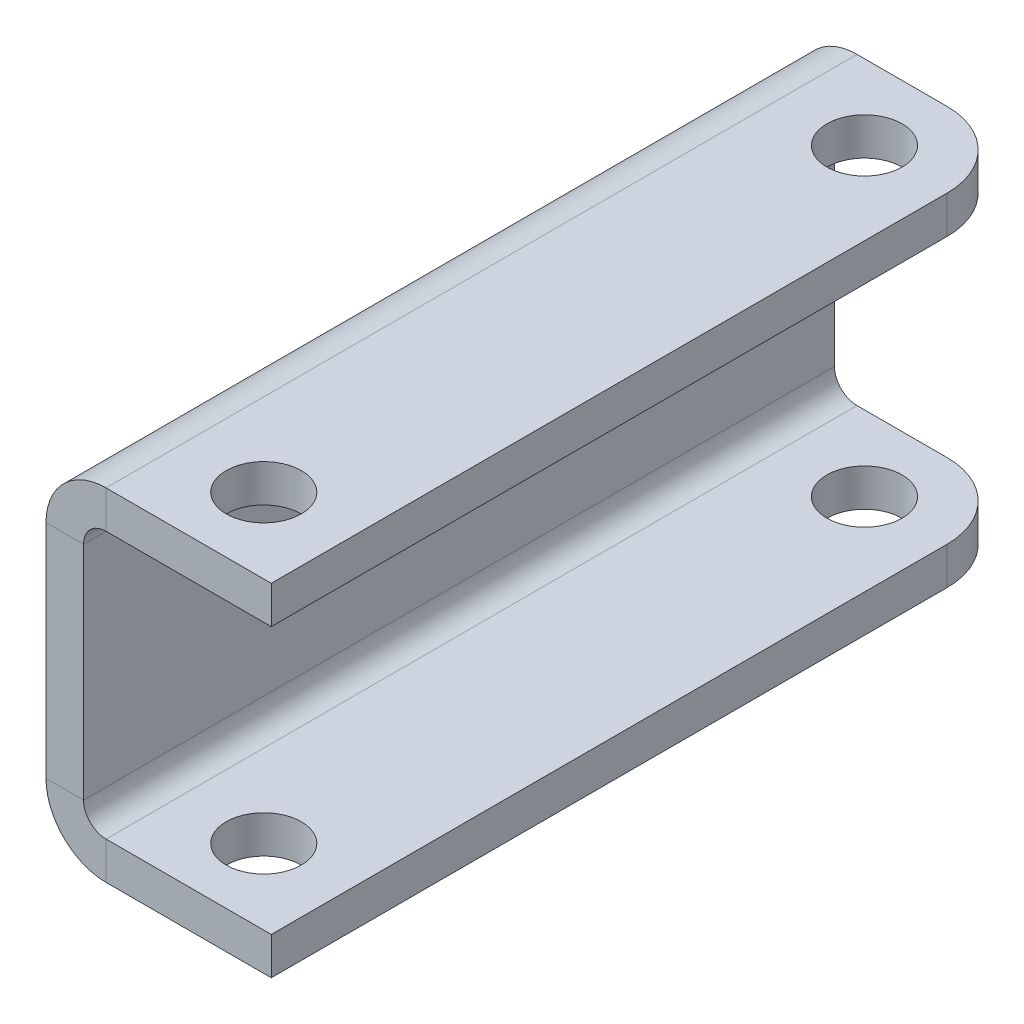
ISO-10303-21;
HEADER;
FILE_DESCRIPTION(('STEP AP214'),'2;1');
FILE_NAME('part.step','',(''),(''),'','','');
FILE_SCHEMA(('AUTOMOTIVE_DESIGN { 1 0 10303 214 1 1 1 1 }'));
ENDSEC;
DATA;
#1=APPLICATION_CONTEXT('core data for automotive mechanical design processes');
#2=APPLICATION_PROTOCOL_DEFINITION('international standard','automotive_design',2000,#1);
#3=PRODUCT_CONTEXT('',#1,'mechanical');
#4=PRODUCT('Part','Part','',(#3));
#5=PRODUCT_RELATED_PRODUCT_CATEGORY('part','',(#4));
#6=PRODUCT_DEFINITION_FORMATION('','',#4);
#7=PRODUCT_DEFINITION_CONTEXT('part definition',#1,'design');
#8=PRODUCT_DEFINITION('design','',#6,#7);
#9=PRODUCT_DEFINITION_SHAPE('','',#8);
#10=(LENGTH_UNIT() NAMED_UNIT(*) SI_UNIT(.MILLI.,.METRE.));
#11=(NAMED_UNIT(*) PLANE_ANGLE_UNIT() SI_UNIT($,.RADIAN.));
#12=(NAMED_UNIT(*) SI_UNIT($,.STERADIAN.) SOLID_ANGLE_UNIT());
#13=UNCERTAINTY_MEASURE_WITH_UNIT(LENGTH_MEASURE(1.E-05),#10,'distance_accuracy_value','');
#14=(GEOMETRIC_REPRESENTATION_CONTEXT(3) GLOBAL_UNCERTAINTY_ASSIGNED_CONTEXT((#13)) GLOBAL_UNIT_ASSIGNED_CONTEXT((#10,
#11,#12)) REPRESENTATION_CONTEXT('',''));
#15=CARTESIAN_POINT('',(0.,0.,0.));
#16=DIRECTION('',(0.,0.,1.));
#17=DIRECTION('',(1.,0.,0.));
#18=AXIS2_PLACEMENT_3D('',#15,#16,#17);
#19=CARTESIAN_POINT('',(346.,29.4999999999994,100.));
#20=DIRECTION('',(0.,0.,1.));
#21=DIRECTION('',(1.,0.,0.));
#22=AXIS2_PLACEMENT_3D('',#19,#20,#21);
#23=PLANE('',#22);
#24=DIRECTION('',(-1.,0.,0.));
#25=VECTOR('',#24,1.);
#26=CARTESIAN_POINT('',(330.,29.4999999999994,100.));
#27=LINE('',#26,#25);
#28=CARTESIAN_POINT('',(340.,29.4999999999994,100.));
#29=VERTEX_POINT('',#28);
#30=CARTESIAN_POINT('',(330.,29.4999999999994,100.));
#31=VERTEX_POINT('',#30);
#32=EDGE_CURVE('E11',#29,#31,#27,.T.);
#33=ORIENTED_EDGE('',*,*,#32,.F.);
#34=CARTESIAN_POINT('',(346.,29.4999999999994,100.));
#35=DIRECTION('',(0.,0.,1.));
#36=DIRECTION('',(1.,0.,0.));
#37=AXIS2_PLACEMENT_3D('',#34,#35,#36);
#38=CIRCLE('',#37,6.);
#39=CARTESIAN_POINT('',(346.,35.4999999999994,100.));
#40=VERTEX_POINT('',#39);
#41=EDGE_CURVE('E105',#29,#40,#38,.F.);
#42=ORIENTED_EDGE('',*,*,#41,.T.);
#43=DIRECTION('',(0.,1.,0.));
#44=VECTOR('',#43,1.);
#45=CARTESIAN_POINT('',(346.,45.4999999999994,100.));
#46=LINE('',#45,#44);
#47=CARTESIAN_POINT('',(346.,45.4999999999994,100.));
#48=VERTEX_POINT('',#47);
#49=EDGE_CURVE('E47',#40,#48,#46,.T.);
#50=ORIENTED_EDGE('',*,*,#49,.T.);
#51=CARTESIAN_POINT('',(346.,29.4999999999994,100.));
#52=DIRECTION('',(0.,0.,-1.));
#53=DIRECTION('',(-1.,0.,0.));
#54=AXIS2_PLACEMENT_3D('',#51,#52,#53);
#55=CIRCLE('',#54,16.);
#56=EDGE_CURVE('E108',#31,#48,#55,.T.);
#57=ORIENTED_EDGE('',*,*,#56,.F.);
#58=EDGE_LOOP('',(#33,#42,#50,#57));
#59=FACE_BOUND('',#58,.T.);
#60=ADVANCED_FACE('F37',(#59),#23,.T.);
#61=CARTESIAN_POINT('',(340.,45.4999999999994,100.));
#62=DIRECTION('',(0.,0.,-1.));
#63=DIRECTION('',(1.,0.,0.));
#64=AXIS2_PLACEMENT_3D('',#61,#62,#63);
#65=PLANE('',#64);
#66=ORIENTED_EDGE('',*,*,#49,.F.);
#67=DIRECTION('',(1.,0.,0.));
#68=VECTOR('',#67,1.);
#69=CARTESIAN_POINT('',(340.,35.4999999999994,100.));
#70=LINE('',#69,#68);
#71=CARTESIAN_POINT('',(390.,35.4999999999994,100.));
#72=VERTEX_POINT('',#71);
#73=EDGE_CURVE('E141',#40,#72,#70,.T.);
#74=ORIENTED_EDGE('',*,*,#73,.T.);
#75=DIRECTION('',(0.,1.,0.));
#76=VECTOR('',#75,1.);
#77=CARTESIAN_POINT('',(390.,45.4999999999994,100.));
#78=LINE('',#77,#76);
#79=CARTESIAN_POINT('',(390.,45.4999999999994,100.));
#80=VERTEX_POINT('',#79);
#81=EDGE_CURVE('E187',#72,#80,#78,.T.);
#82=ORIENTED_EDGE('',*,*,#81,.T.);
#83=DIRECTION('',(1.,0.,0.));
#84=VECTOR('',#83,1.);
#85=CARTESIAN_POINT('',(340.,45.4999999999994,100.));
#86=LINE('',#85,#84);
#87=EDGE_CURVE('E208',#48,#80,#86,.T.);
#88=ORIENTED_EDGE('',*,*,#87,.F.);
#89=EDGE_LOOP('',(#66,#74,#82,#88));
#90=FACE_BOUND('',#89,.T.);
#91=ADVANCED_FACE('F209',(#90),#65,.F.);
#92=CARTESIAN_POINT('',(390.,45.4999999999994,-100.));
#93=DIRECTION('',(1.,0.,0.));
#94=DIRECTION('',(0.,0.,1.));
#95=AXIS2_PLACEMENT_3D('',#92,#93,#94);
#96=PLANE('',#95);
#97=ORIENTED_EDGE('',*,*,#81,.F.);
#98=DIRECTION('',(0.,0.,1.));
#99=VECTOR('',#98,1.);
#100=CARTESIAN_POINT('',(390.,35.4999999999994,-100.));
#101=LINE('',#100,#99);
#102=CARTESIAN_POINT('',(390.,35.4999999999994,-80.));
#103=VERTEX_POINT('',#102);
#104=EDGE_CURVE('E159',#103,#72,#101,.T.);
#105=ORIENTED_EDGE('',*,*,#104,.F.);
#106=DIRECTION('',(0.,1.,0.));
#107=VECTOR('',#106,1.);
#108=CARTESIAN_POINT('',(390.,45.4999999999994,-80.));
#109=LINE('',#108,#107);
#110=CARTESIAN_POINT('',(390.,45.4999999999994,-80.));
#111=VERTEX_POINT('',#110);
#112=EDGE_CURVE('E184',#103,#111,#109,.T.);
#113=ORIENTED_EDGE('',*,*,#112,.T.);
#114=DIRECTION('',(0.,0.,1.));
#115=VECTOR('',#114,1.);
#116=CARTESIAN_POINT('',(390.,45.4999999999994,-100.));
#117=LINE('',#116,#115);
#118=EDGE_CURVE('E296',#111,#80,#117,.T.);
#119=ORIENTED_EDGE('',*,*,#118,.T.);
#120=EDGE_LOOP('',(#97,#105,#113,#119));
#121=FACE_BOUND('',#120,.T.);
#122=ADVANCED_FACE('F295',(#121),#96,.T.);
#123=CARTESIAN_POINT('',(370.,45.4999999999994,-80.));
#124=DIRECTION('',(0.,-1.,0.));
#125=DIRECTION('',(1.,0.,0.));
#126=AXIS2_PLACEMENT_3D('',#123,#124,#125);
#127=CYLINDRICAL_SURFACE('',#126,20.);
#128=ORIENTED_EDGE('',*,*,#112,.F.);
#129=CARTESIAN_POINT('',(370.,35.4999999999994,-80.));
#130=DIRECTION('',(0.,-1.,0.));
#131=DIRECTION('',(1.,0.,0.));
#132=AXIS2_PLACEMENT_3D('',#129,#130,#131);
#133=CIRCLE('',#132,20.);
#134=CARTESIAN_POINT('',(370.,35.4999999999994,-100.));
#135=VERTEX_POINT('',#134);
#136=EDGE_CURVE('E286',#103,#135,#133,.F.);
#137=ORIENTED_EDGE('',*,*,#136,.T.);
#138=DIRECTION('',(0.,1.,0.));
#139=VECTOR('',#138,1.);
#140=CARTESIAN_POINT('',(370.,45.4999999999994,-100.));
#141=LINE('',#140,#139);
#142=CARTESIAN_POINT('',(370.,45.4999999999994,-100.));
#143=VERTEX_POINT('',#142);
#144=EDGE_CURVE('E181',#135,#143,#141,.T.);
#145=ORIENTED_EDGE('',*,*,#144,.T.);
#146=CARTESIAN_POINT('',(370.,45.4999999999994,-80.));
#147=DIRECTION('',(0.,-1.,0.));
#148=DIRECTION('',(1.,0.,0.));
#149=AXIS2_PLACEMENT_3D('',#146,#147,#148);
#150=CIRCLE('',#149,20.);
#151=EDGE_CURVE('E222',#111,#143,#150,.F.);
#152=ORIENTED_EDGE('',*,*,#151,.F.);
#153=EDGE_LOOP('',(#128,#137,#145,#152));
#154=FACE_BOUND('',#153,.T.);
#155=ADVANCED_FACE('F387',(#154),#127,.T.);
#156=CARTESIAN_POINT('',(340.,45.4999999999994,-100.));
#157=DIRECTION('',(0.,0.,-1.));
#158=DIRECTION('',(1.,0.,0.));
#159=AXIS2_PLACEMENT_3D('',#156,#157,#158);
#160=PLANE('',#159);
#161=ORIENTED_EDGE('',*,*,#144,.F.);
#162=DIRECTION('',(1.,0.,0.));
#163=VECTOR('',#162,1.);
#164=CARTESIAN_POINT('',(340.,35.4999999999994,-100.));
#165=LINE('',#164,#163);
#166=CARTESIAN_POINT('',(346.,35.4999999999994,-100.));
#167=VERTEX_POINT('',#166);
#168=EDGE_CURVE('E266',#167,#135,#165,.T.);
#169=ORIENTED_EDGE('',*,*,#168,.F.);
#170=DIRECTION('',(0.,1.,0.));
#171=VECTOR('',#170,1.);
#172=CARTESIAN_POINT('',(346.,45.4999999999994,-100.));
#173=LINE('',#172,#171);
#174=CARTESIAN_POINT('',(346.,45.4999999999994,-100.));
#175=VERTEX_POINT('',#174);
#176=EDGE_CURVE('E178',#167,#175,#173,.T.);
#177=ORIENTED_EDGE('',*,*,#176,.T.);
#178=DIRECTION('',(1.,0.,0.));
#179=VECTOR('',#178,1.);
#180=CARTESIAN_POINT('',(340.,45.4999999999994,-100.));
#181=LINE('',#180,#179);
#182=EDGE_CURVE('E219',#175,#143,#181,.T.);
#183=ORIENTED_EDGE('',*,*,#182,.T.);
#184=EDGE_LOOP('',(#161,#169,#177,#183));
#185=FACE_BOUND('',#184,.T.);
#186=ADVANCED_FACE('F383',(#185),#160,.T.);
#187=CARTESIAN_POINT('',(346.,29.4999999999994,-100.));
#188=DIRECTION('',(0.,0.,1.));
#189=DIRECTION('',(1.,0.,0.));
#190=AXIS2_PLACEMENT_3D('',#187,#188,#189);
#191=PLANE('',#190);
#192=ORIENTED_EDGE('',*,*,#176,.F.);
#193=CARTESIAN_POINT('',(346.,29.4999999999994,-100.));
#194=DIRECTION('',(0.,0.,1.));
#195=DIRECTION('',(1.,0.,0.));
#196=AXIS2_PLACEMENT_3D('',#193,#194,#195);
#197=CIRCLE('',#196,6.);
#198=CARTESIAN_POINT('',(340.,29.4999999999994,-100.));
#199=VERTEX_POINT('',#198);
#200=EDGE_CURVE('E134',#199,#167,#197,.F.);
#201=ORIENTED_EDGE('',*,*,#200,.F.);
#202=DIRECTION('',(-1.,0.,0.));
#203=VECTOR('',#202,1.);
#204=CARTESIAN_POINT('',(330.,29.4999999999994,-100.));
#205=LINE('',#204,#203);
#206=CARTESIAN_POINT('',(330.,29.4999999999994,-100.));
#207=VERTEX_POINT('',#206);
#208=EDGE_CURVE('E175',#199,#207,#205,.T.);
#209=ORIENTED_EDGE('',*,*,#208,.T.);
#210=CARTESIAN_POINT('',(346.,29.4999999999994,-100.));
#211=DIRECTION('',(0.,0.,-1.));
#212=DIRECTION('',(-1.,0.,0.));
#213=AXIS2_PLACEMENT_3D('',#210,#211,#212);
#214=CIRCLE('',#213,16.);
#215=EDGE_CURVE('E204',#207,#175,#214,.T.);
#216=ORIENTED_EDGE('',*,*,#215,.T.);
#217=EDGE_LOOP('',(#192,#201,#209,#216));
#218=FACE_BOUND('',#217,.T.);
#219=ADVANCED_FACE('F379',(#218),#191,.F.);
#220=CARTESIAN_POINT('',(330.,-35.5000000000006,-100.));
#221=DIRECTION('',(0.,0.,-1.));
#222=DIRECTION('',(0.,1.,0.));
#223=AXIS2_PLACEMENT_3D('',#220,#221,#222);
#224=PLANE('',#223);
#225=ORIENTED_EDGE('',*,*,#208,.F.);
#226=DIRECTION('',(0.,1.,0.));
#227=VECTOR('',#226,1.);
#228=CARTESIAN_POINT('',(340.,-35.5000000000006,-100.));
#229=LINE('',#228,#227);
#230=CARTESIAN_POINT('',(340.,-29.5000000000006,-100.));
#231=VERTEX_POINT('',#230);
#232=EDGE_CURVE('E124',#231,#199,#229,.T.);
#233=ORIENTED_EDGE('',*,*,#232,.F.);
#234=DIRECTION('',(-1.,0.,0.));
#235=VECTOR('',#234,1.);
#236=CARTESIAN_POINT('',(330.,-29.5000000000006,-100.));
#237=LINE('',#236,#235);
#238=CARTESIAN_POINT('',(330.,-29.5000000000006,-100.));
#239=VERTEX_POINT('',#238);
#240=EDGE_CURVE('E172',#231,#239,#237,.T.);
#241=ORIENTED_EDGE('',*,*,#240,.T.);
#242=DIRECTION('',(0.,1.,0.));
#243=VECTOR('',#242,1.);
#244=CARTESIAN_POINT('',(330.,-35.5000000000006,-100.));
#245=LINE('',#244,#243);
#246=EDGE_CURVE('E228',#239,#207,#245,.T.);
#247=ORIENTED_EDGE('',*,*,#246,.T.);
#248=EDGE_LOOP('',(#225,#233,#241,#247));
#249=FACE_BOUND('',#248,.T.);
#250=ADVANCED_FACE('F376',(#249),#224,.T.);
#251=CARTESIAN_POINT('',(346.,-29.5000000000006,-100.));
#252=DIRECTION('',(0.,0.,1.));
#253=DIRECTION('',(1.,0.,0.));
#254=AXIS2_PLACEMENT_3D('',#251,#252,#253);
#255=PLANE('',#254);
#256=ORIENTED_EDGE('',*,*,#240,.F.);
#257=CARTESIAN_POINT('',(346.,-29.5000000000006,-100.));
#258=DIRECTION('',(0.,0.,1.));
#259=DIRECTION('',(1.,0.,0.));
#260=AXIS2_PLACEMENT_3D('',#257,#258,#259);
#261=CIRCLE('',#260,6.);
#262=CARTESIAN_POINT('',(346.,-35.5000000000006,-100.));
#263=VERTEX_POINT('',#262);
#264=EDGE_CURVE('E268',#263,#231,#261,.F.);
#265=ORIENTED_EDGE('',*,*,#264,.F.);
#266=DIRECTION('',(0.,-1.,0.));
#267=VECTOR('',#266,1.);
#268=CARTESIAN_POINT('',(346.,-45.5000000000006,-100.));
#269=LINE('',#268,#267);
#270=CARTESIAN_POINT('',(346.,-45.5000000000006,-100.));
#271=VERTEX_POINT('',#270);
#272=EDGE_CURVE('E55',#263,#271,#269,.T.);
#273=ORIENTED_EDGE('',*,*,#272,.T.);
#274=CARTESIAN_POINT('',(346.,-29.5000000000006,-100.));
#275=DIRECTION('',(0.,0.,-1.));
#276=DIRECTION('',(-1.,0.,0.));
#277=AXIS2_PLACEMENT_3D('',#274,#275,#276);
#278=CIRCLE('',#277,16.);
#279=EDGE_CURVE('E257',#271,#239,#278,.T.);
#280=ORIENTED_EDGE('',*,*,#279,.T.);
#281=EDGE_LOOP('',(#256,#265,#273,#280));
#282=FACE_BOUND('',#281,.T.);
#283=ADVANCED_FACE('F372',(#282),#255,.F.);
#284=CARTESIAN_POINT('',(340.,-45.5000000000006,-100.));
#285=DIRECTION('',(0.,0.,-1.));
#286=DIRECTION('',(-1.,0.,0.));
#287=AXIS2_PLACEMENT_3D('',#284,#285,#286);
#288=PLANE('',#287);
#289=ORIENTED_EDGE('',*,*,#272,.F.);
#290=DIRECTION('',(-1.,0.,0.));
#291=VECTOR('',#290,1.);
#292=CARTESIAN_POINT('',(340.,-35.5000000000006,-100.));
#293=LINE('',#292,#291);
#294=CARTESIAN_POINT('',(370.,-35.5000000000006,-100.));
#295=VERTEX_POINT('',#294);
#296=EDGE_CURVE('E152',#295,#263,#293,.T.);
#297=ORIENTED_EDGE('',*,*,#296,.F.);
#298=DIRECTION('',(0.,-1.,0.));
#299=VECTOR('',#298,1.);
#300=CARTESIAN_POINT('',(370.,-45.5000000000006,-100.));
#301=LINE('',#300,#299);
#302=CARTESIAN_POINT('',(370.,-45.5000000000006,-100.));
#303=VERTEX_POINT('',#302);
#304=EDGE_CURVE('E168',#295,#303,#301,.T.);
#305=ORIENTED_EDGE('',*,*,#304,.T.);
#306=DIRECTION('',(-1.,0.,0.));
#307=VECTOR('',#306,1.);
#308=CARTESIAN_POINT('',(340.,-45.5000000000006,-100.));
#309=LINE('',#308,#307);
#310=EDGE_CURVE('E240',#303,#271,#309,.T.);
#311=ORIENTED_EDGE('',*,*,#310,.T.);
#312=EDGE_LOOP('',(#289,#297,#305,#311));
#313=FACE_BOUND('',#312,.T.);
#314=ADVANCED_FACE('F368',(#313),#288,.T.);
#315=CARTESIAN_POINT('',(370.,-45.5000000000006,-80.));
#316=DIRECTION('',(0.,1.,0.));
#317=DIRECTION('',(-1.,0.,0.));
#318=AXIS2_PLACEMENT_3D('',#315,#316,#317);
#319=CYLINDRICAL_SURFACE('',#318,20.);
#320=ORIENTED_EDGE('',*,*,#304,.F.);
#321=CARTESIAN_POINT('',(370.,-35.5000000000006,-80.));
#322=DIRECTION('',(0.,1.,0.));
#323=DIRECTION('',(-1.,0.,0.));
#324=AXIS2_PLACEMENT_3D('',#321,#322,#323);
#325=CIRCLE('',#324,20.);
#326=CARTESIAN_POINT('',(390.,-35.5000000000006,-80.));
#327=VERTEX_POINT('',#326);
#328=EDGE_CURVE('E274',#295,#327,#325,.F.);
#329=ORIENTED_EDGE('',*,*,#328,.T.);
#330=DIRECTION('',(0.,-1.,0.));
#331=VECTOR('',#330,1.);
#332=CARTESIAN_POINT('',(390.,-45.5000000000006,-80.));
#333=LINE('',#332,#331);
#334=CARTESIAN_POINT('',(390.,-45.5000000000006,-80.));
#335=VERTEX_POINT('',#334);
#336=EDGE_CURVE('E165',#327,#335,#333,.T.);
#337=ORIENTED_EDGE('',*,*,#336,.T.);
#338=CARTESIAN_POINT('',(370.,-45.5000000000006,-80.));
#339=DIRECTION('',(0.,1.,0.));
#340=DIRECTION('',(-1.,0.,0.));
#341=AXIS2_PLACEMENT_3D('',#338,#339,#340);
#342=CIRCLE('',#341,20.);
#343=EDGE_CURVE('E242',#303,#335,#342,.F.);
#344=ORIENTED_EDGE('',*,*,#343,.F.);
#345=EDGE_LOOP('',(#320,#329,#337,#344));
#346=FACE_BOUND('',#345,.T.);
#347=ADVANCED_FACE('F364',(#346),#319,.T.);
#348=CARTESIAN_POINT('',(390.,-45.5000000000006,-100.));
#349=DIRECTION('',(-1.,0.,0.));
#350=DIRECTION('',(0.,0.,1.));
#351=AXIS2_PLACEMENT_3D('',#348,#349,#350);
#352=PLANE('',#351);
#353=ORIENTED_EDGE('',*,*,#336,.F.);
#354=DIRECTION('',(0.,0.,1.));
#355=VECTOR('',#354,1.);
#356=CARTESIAN_POINT('',(390.,-35.5000000000006,-100.));
#357=LINE('',#356,#355);
#358=CARTESIAN_POINT('',(390.,-35.5000000000006,100.));
#359=VERTEX_POINT('',#358);
#360=EDGE_CURVE('E271',#327,#359,#357,.T.);
#361=ORIENTED_EDGE('',*,*,#360,.T.);
#362=DIRECTION('',(0.,-1.,0.));
#363=VECTOR('',#362,1.);
#364=CARTESIAN_POINT('',(390.,-45.5000000000006,100.));
#365=LINE('',#364,#363);
#366=CARTESIAN_POINT('',(390.,-45.5000000000006,100.));
#367=VERTEX_POINT('',#366);
#368=EDGE_CURVE('E162',#359,#367,#365,.T.);
#369=ORIENTED_EDGE('',*,*,#368,.T.);
#370=DIRECTION('',(0.,0.,1.));
#371=VECTOR('',#370,1.);
#372=CARTESIAN_POINT('',(390.,-45.5000000000006,-100.));
#373=LINE('',#372,#371);
#374=EDGE_CURVE('E245',#335,#367,#373,.T.);
#375=ORIENTED_EDGE('',*,*,#374,.F.);
#376=EDGE_LOOP('',(#353,#361,#369,#375));
#377=FACE_BOUND('',#376,.T.);
#378=ADVANCED_FACE('F358',(#377),#352,.F.);
#379=CARTESIAN_POINT('',(340.,-45.5000000000006,100.));
#380=DIRECTION('',(0.,0.,-1.));
#381=DIRECTION('',(-1.,0.,0.));
#382=AXIS2_PLACEMENT_3D('',#379,#380,#381);
#383=PLANE('',#382);
#384=ORIENTED_EDGE('',*,*,#368,.F.);
#385=DIRECTION('',(-1.,0.,0.));
#386=VECTOR('',#385,1.);
#387=CARTESIAN_POINT('',(340.,-35.5000000000006,100.));
#388=LINE('',#387,#386);
#389=CARTESIAN_POINT('',(346.,-35.5000000000006,100.));
#390=VERTEX_POINT('',#389);
#391=EDGE_CURVE('E263',#359,#390,#388,.T.);
#392=ORIENTED_EDGE('',*,*,#391,.T.);
#393=DIRECTION('',(0.,-1.,0.));
#394=VECTOR('',#393,1.);
#395=CARTESIAN_POINT('',(346.,-45.5000000000006,100.));
#396=LINE('',#395,#394);
#397=CARTESIAN_POINT('',(346.,-45.5000000000006,100.));
#398=VERTEX_POINT('',#397);
#399=EDGE_CURVE('E160',#390,#398,#396,.T.);
#400=ORIENTED_EDGE('',*,*,#399,.T.);
#401=DIRECTION('',(-1.,0.,0.));
#402=VECTOR('',#401,1.);
#403=CARTESIAN_POINT('',(340.,-45.5000000000006,100.));
#404=LINE('',#403,#402);
#405=EDGE_CURVE('E248',#367,#398,#404,.T.);
#406=ORIENTED_EDGE('',*,*,#405,.F.);
#407=EDGE_LOOP('',(#384,#392,#400,#406));
#408=FACE_BOUND('',#407,.T.);
#409=ADVANCED_FACE('F353',(#408),#383,.F.);
#410=CARTESIAN_POINT('',(346.,-29.5000000000006,100.));
#411=DIRECTION('',(0.,0.,1.));
#412=DIRECTION('',(1.,0.,0.));
#413=AXIS2_PLACEMENT_3D('',#410,#411,#412);
#414=PLANE('',#413);
#415=ORIENTED_EDGE('',*,*,#399,.F.);
#416=CARTESIAN_POINT('',(346.,-29.5000000000006,100.));
#417=DIRECTION('',(0.,0.,1.));
#418=DIRECTION('',(1.,0.,0.));
#419=AXIS2_PLACEMENT_3D('',#416,#417,#418);
#420=CIRCLE('',#419,6.);
#421=CARTESIAN_POINT('',(340.,-29.5000000000006,100.));
#422=VERTEX_POINT('',#421);
#423=EDGE_CURVE('E262',#390,#422,#420,.F.);
#424=ORIENTED_EDGE('',*,*,#423,.T.);
#425=DIRECTION('',(-1.,0.,0.));
#426=VECTOR('',#425,1.);
#427=CARTESIAN_POINT('',(330.,-29.5000000000006,100.));
#428=LINE('',#427,#426);
#429=CARTESIAN_POINT('',(330.,-29.5000000000006,100.));
#430=VERTEX_POINT('',#429);
#431=EDGE_CURVE('E41',#422,#430,#428,.T.);
#432=ORIENTED_EDGE('',*,*,#431,.T.);
#433=CARTESIAN_POINT('',(346.,-29.5000000000006,100.));
#434=DIRECTION('',(0.,0.,-1.));
#435=DIRECTION('',(-1.,0.,0.));
#436=AXIS2_PLACEMENT_3D('',#433,#434,#435);
#437=CIRCLE('',#436,16.);
#438=EDGE_CURVE('E254',#398,#430,#437,.T.);
#439=ORIENTED_EDGE('',*,*,#438,.F.);
#440=EDGE_LOOP('',(#415,#424,#432,#439));
#441=FACE_BOUND('',#440,.T.);
#442=ADVANCED_FACE('F349',(#441),#414,.T.);
#443=CARTESIAN_POINT('',(368.,45.4999999999994,-80.));
#444=DIRECTION('',(0.,-1.,0.));
#445=DIRECTION('',(1.,0.,0.));
#446=AXIS2_PLACEMENT_3D('',#443,#444,#445);
#447=CYLINDRICAL_SURFACE('',#446,10.0000000000001);
#448=CARTESIAN_POINT('',(368.,45.4999999999994,-80.));
#449=DIRECTION('',(0.,1.,0.));
#450=DIRECTION('',(-1.,0.,0.));
#451=AXIS2_PLACEMENT_3D('',#448,#449,#450);
#452=CIRCLE('',#451,10.0000000000001);
#453=CARTESIAN_POINT('',(358.,45.4999999999994,-80.));
#454=VERTEX_POINT('',#453);
#455=EDGE_CURVE('E281',#454,#454,#452,.T.);
#456=ORIENTED_EDGE('',*,*,#455,.T.);
#457=EDGE_LOOP('',(#456));
#458=FACE_BOUND('',#457,.T.);
#459=CARTESIAN_POINT('',(368.,35.4999999999994,-80.));
#460=DIRECTION('',(0.,1.,0.));
#461=DIRECTION('',(-1.,0.,0.));
#462=AXIS2_PLACEMENT_3D('',#459,#460,#461);
#463=CIRCLE('',#462,10.0000000000001);
#464=CARTESIAN_POINT('',(358.,35.4999999999994,-80.));
#465=VERTEX_POINT('',#464);
#466=EDGE_CURVE('E153',#465,#465,#463,.T.);
#467=ORIENTED_EDGE('',*,*,#466,.F.);
#468=EDGE_LOOP('',(#467));
#469=FACE_BOUND('',#468,.T.);
#470=ADVANCED_FACE('F307',(#458,#469),#447,.F.);
#471=CARTESIAN_POINT('',(368.,45.4999999999994,80.));
#472=DIRECTION('',(0.,-1.,0.));
#473=DIRECTION('',(1.,0.,0.));
#474=AXIS2_PLACEMENT_3D('',#471,#472,#473);
#475=CYLINDRICAL_SURFACE('',#474,10.0000000000001);
#476=CARTESIAN_POINT('',(368.,45.4999999999994,80.));
#477=DIRECTION('',(0.,1.,0.));
#478=DIRECTION('',(1.,0.,0.));
#479=AXIS2_PLACEMENT_3D('',#476,#477,#478);
#480=CIRCLE('',#479,10.0000000000001);
#481=CARTESIAN_POINT('',(378.,45.4999999999994,80.));
#482=VERTEX_POINT('',#481);
#483=EDGE_CURVE('E299',#482,#482,#480,.T.);
#484=ORIENTED_EDGE('',*,*,#483,.T.);
#485=EDGE_LOOP('',(#484));
#486=FACE_BOUND('',#485,.T.);
#487=CARTESIAN_POINT('',(368.,35.4999999999994,80.));
#488=DIRECTION('',(0.,1.,0.));
#489=DIRECTION('',(-1.,0.,0.));
#490=AXIS2_PLACEMENT_3D('',#487,#488,#489);
#491=CIRCLE('',#490,10.0000000000001);
#492=CARTESIAN_POINT('',(358.,35.4999999999994,80.));
#493=VERTEX_POINT('',#492);
#494=EDGE_CURVE('E156',#493,#493,#491,.T.);
#495=ORIENTED_EDGE('',*,*,#494,.F.);
#496=EDGE_LOOP('',(#495));
#497=FACE_BOUND('',#496,.T.);
#498=ADVANCED_FACE('F39',(#486,#497),#475,.F.);
#499=CARTESIAN_POINT('',(368.,-45.5000000000006,-80.));
#500=DIRECTION('',(0.,1.,0.));
#501=DIRECTION('',(-1.,0.,0.));
#502=AXIS2_PLACEMENT_3D('',#499,#500,#501);
#503=CYLINDRICAL_SURFACE('',#502,10.0000000000001);
#504=CARTESIAN_POINT('',(368.,-45.5000000000006,-80.));
#505=DIRECTION('',(0.,1.,0.));
#506=DIRECTION('',(-1.,0.,0.));
#507=AXIS2_PLACEMENT_3D('',#504,#505,#506);
#508=CIRCLE('',#507,10.0000000000001);
#509=CARTESIAN_POINT('',(358.,-45.5000000000006,-80.));
#510=VERTEX_POINT('',#509);
#511=EDGE_CURVE('E234',#510,#510,#508,.F.);
#512=ORIENTED_EDGE('',*,*,#511,.T.);
#513=EDGE_LOOP('',(#512));
#514=FACE_BOUND('',#513,.T.);
#515=CARTESIAN_POINT('',(368.,-35.5000000000006,-80.));
#516=DIRECTION('',(0.,1.,0.));
#517=DIRECTION('',(-1.,0.,0.));
#518=AXIS2_PLACEMENT_3D('',#515,#516,#517);
#519=CIRCLE('',#518,10.0000000000001);
#520=CARTESIAN_POINT('',(358.,-35.5000000000006,-80.));
#521=VERTEX_POINT('',#520);
#522=EDGE_CURVE('E146',#521,#521,#519,.F.);
#523=ORIENTED_EDGE('',*,*,#522,.F.);
#524=EDGE_LOOP('',(#523));
#525=FACE_BOUND('',#524,.T.);
#526=ADVANCED_FACE('F319',(#514,#525),#503,.F.);
#527=CARTESIAN_POINT('',(368.,-45.5000000000006,80.));
#528=DIRECTION('',(0.,1.,0.));
#529=DIRECTION('',(-1.,0.,0.));
#530=AXIS2_PLACEMENT_3D('',#527,#528,#529);
#531=CYLINDRICAL_SURFACE('',#530,10.0000000000001);
#532=CARTESIAN_POINT('',(368.,-45.5000000000006,80.));
#533=DIRECTION('',(0.,1.,0.));
#534=DIRECTION('',(-1.,0.,0.));
#535=AXIS2_PLACEMENT_3D('',#532,#533,#534);
#536=CIRCLE('',#535,10.0000000000001);
#537=CARTESIAN_POINT('',(358.,-45.5000000000006,80.));
#538=VERTEX_POINT('',#537);
#539=EDGE_CURVE('E237',#538,#538,#536,.F.);
#540=ORIENTED_EDGE('',*,*,#539,.T.);
#541=EDGE_LOOP('',(#540));
#542=FACE_BOUND('',#541,.T.);
#543=CARTESIAN_POINT('',(368.,-35.5000000000006,80.));
#544=DIRECTION('',(0.,1.,0.));
#545=DIRECTION('',(-1.,0.,0.));
#546=AXIS2_PLACEMENT_3D('',#543,#544,#545);
#547=CIRCLE('',#546,10.0000000000001);
#548=CARTESIAN_POINT('',(358.,-35.5000000000006,80.));
#549=VERTEX_POINT('',#548);
#550=EDGE_CURVE('E149',#549,#549,#547,.F.);
#551=ORIENTED_EDGE('',*,*,#550,.F.);
#552=EDGE_LOOP('',(#551));
#553=FACE_BOUND('',#552,.T.);
#554=ADVANCED_FACE('F342',(#542,#553),#531,.F.);
#555=CARTESIAN_POINT('',(330.,-35.5000000000006,100.));
#556=DIRECTION('',(0.,0.,-1.));
#557=DIRECTION('',(0.,1.,0.));
#558=AXIS2_PLACEMENT_3D('',#555,#556,#557);
#559=PLANE('',#558);
#560=DIRECTION('',(0.,1.,0.));
#561=VECTOR('',#560,1.);
#562=CARTESIAN_POINT('',(340.,-35.5000000000006,100.));
#563=LINE('',#562,#561);
#564=EDGE_CURVE('E121',#422,#29,#563,.T.);
#565=ORIENTED_EDGE('',*,*,#564,.T.);
#566=ORIENTED_EDGE('',*,*,#32,.T.);
#567=DIRECTION('',(0.,1.,0.));
#568=VECTOR('',#567,1.);
#569=CARTESIAN_POINT('',(330.,-35.5000000000006,100.));
#570=LINE('',#569,#568);
#571=EDGE_CURVE('E213',#430,#31,#570,.T.);
#572=ORIENTED_EDGE('',*,*,#571,.F.);
#573=ORIENTED_EDGE('',*,*,#431,.F.);
#574=EDGE_LOOP('',(#565,#566,#572,#573));
#575=FACE_BOUND('',#574,.T.);
#576=ADVANCED_FACE('F138',(#575),#559,.F.);
#577=CARTESIAN_POINT('',(346.,-29.5000000000006,-100.));
#578=DIRECTION('',(0.,0.,1.));
#579=DIRECTION('',(1.,0.,0.));
#580=AXIS2_PLACEMENT_3D('',#577,#578,#579);
#581=CYLINDRICAL_SURFACE('',#580,16.);
#582=ORIENTED_EDGE('',*,*,#438,.T.);
#583=DIRECTION('',(0.,0.,1.));
#584=VECTOR('',#583,1.);
#585=CARTESIAN_POINT('',(330.,-29.5000000000006,-100.));
#586=LINE('',#585,#584);
#587=EDGE_CURVE('E205',#239,#430,#586,.T.);
#588=ORIENTED_EDGE('',*,*,#587,.F.);
#589=ORIENTED_EDGE('',*,*,#279,.F.);
#590=DIRECTION('',(0.,0.,1.));
#591=VECTOR('',#590,1.);
#592=CARTESIAN_POINT('',(346.,-45.5000000000006,-100.));
#593=LINE('',#592,#591);
#594=EDGE_CURVE('E251',#271,#398,#593,.T.);
#595=ORIENTED_EDGE('',*,*,#594,.T.);
#596=EDGE_LOOP('',(#582,#588,#589,#595));
#597=FACE_BOUND('',#596,.T.);
#598=ADVANCED_FACE('F341',(#597),#581,.T.);
#599=CARTESIAN_POINT('',(340.,-45.5000000000006,-100.));
#600=DIRECTION('',(0.,1.,0.));
#601=DIRECTION('',(-1.,0.,0.));
#602=AXIS2_PLACEMENT_3D('',#599,#600,#601);
#603=PLANE('',#602);
#604=ORIENTED_EDGE('',*,*,#511,.F.);
#605=EDGE_LOOP('',(#604));
#606=FACE_BOUND('',#605,.T.);
#607=ORIENTED_EDGE('',*,*,#539,.F.);
#608=EDGE_LOOP('',(#607));
#609=FACE_BOUND('',#608,.T.);
#610=ORIENTED_EDGE('',*,*,#310,.F.);
#611=ORIENTED_EDGE('',*,*,#343,.T.);
#612=ORIENTED_EDGE('',*,*,#374,.T.);
#613=ORIENTED_EDGE('',*,*,#405,.T.);
#614=ORIENTED_EDGE('',*,*,#594,.F.);
#615=EDGE_LOOP('',(#610,#611,#612,#613,#614));
#616=FACE_BOUND('',#615,.T.);
#617=ADVANCED_FACE('F595',(#606,#609,#616),#603,.F.);
#618=CARTESIAN_POINT('',(346.,29.4999999999994,-100.));
#619=DIRECTION('',(0.,0.,1.));
#620=DIRECTION('',(1.,0.,0.));
#621=AXIS2_PLACEMENT_3D('',#618,#619,#620);
#622=CYLINDRICAL_SURFACE('',#621,16.);
#623=ORIENTED_EDGE('',*,*,#56,.T.);
#624=DIRECTION('',(0.,0.,1.));
#625=VECTOR('',#624,1.);
#626=CARTESIAN_POINT('',(346.,45.4999999999994,-100.));
#627=LINE('',#626,#625);
#628=EDGE_CURVE('E201',#175,#48,#627,.T.);
#629=ORIENTED_EDGE('',*,*,#628,.F.);
#630=ORIENTED_EDGE('',*,*,#215,.F.);
#631=DIRECTION('',(0.,0.,1.));
#632=VECTOR('',#631,1.);
#633=CARTESIAN_POINT('',(330.,29.4999999999994,-100.));
#634=LINE('',#633,#632);
#635=EDGE_CURVE('E203',#207,#31,#634,.T.);
#636=ORIENTED_EDGE('',*,*,#635,.T.);
#637=EDGE_LOOP('',(#623,#629,#630,#636));
#638=FACE_BOUND('',#637,.T.);
#639=ADVANCED_FACE('F198',(#638),#622,.T.);
#640=CARTESIAN_POINT('',(330.,-35.5000000000006,-100.));
#641=DIRECTION('',(1.,0.,0.));
#642=DIRECTION('',(0.,0.,-1.));
#643=AXIS2_PLACEMENT_3D('',#640,#641,#642);
#644=PLANE('',#643);
#645=ORIENTED_EDGE('',*,*,#571,.T.);
#646=ORIENTED_EDGE('',*,*,#635,.F.);
#647=ORIENTED_EDGE('',*,*,#246,.F.);
#648=ORIENTED_EDGE('',*,*,#587,.T.);
#649=EDGE_LOOP('',(#645,#646,#647,#648));
#650=FACE_BOUND('',#649,.T.);
#651=ADVANCED_FACE('F313',(#650),#644,.F.);
#652=CARTESIAN_POINT('',(340.,45.4999999999994,-100.));
#653=DIRECTION('',(0.,-1.,0.));
#654=DIRECTION('',(1.,0.,0.));
#655=AXIS2_PLACEMENT_3D('',#652,#653,#654);
#656=PLANE('',#655);
#657=ORIENTED_EDGE('',*,*,#455,.F.);
#658=EDGE_LOOP('',(#657));
#659=FACE_BOUND('',#658,.T.);
#660=ORIENTED_EDGE('',*,*,#483,.F.);
#661=EDGE_LOOP('',(#660));
#662=FACE_BOUND('',#661,.T.);
#663=ORIENTED_EDGE('',*,*,#118,.F.);
#664=ORIENTED_EDGE('',*,*,#151,.T.);
#665=ORIENTED_EDGE('',*,*,#182,.F.);
#666=ORIENTED_EDGE('',*,*,#628,.T.);
#667=ORIENTED_EDGE('',*,*,#87,.T.);
#668=EDGE_LOOP('',(#663,#664,#665,#666,#667));
#669=FACE_BOUND('',#668,.T.);
#670=ADVANCED_FACE('F216',(#659,#662,#669),#656,.F.);
#671=CARTESIAN_POINT('',(346.,-29.5000000000006,-100.));
#672=DIRECTION('',(0.,0.,1.));
#673=DIRECTION('',(1.,0.,0.));
#674=AXIS2_PLACEMENT_3D('',#671,#672,#673);
#675=CYLINDRICAL_SURFACE('',#674,6.);
#676=ORIENTED_EDGE('',*,*,#423,.F.);
#677=DIRECTION('',(0.,0.,1.));
#678=VECTOR('',#677,1.);
#679=CARTESIAN_POINT('',(346.,-35.5000000000006,-100.));
#680=LINE('',#679,#678);
#681=EDGE_CURVE('E260',#263,#390,#680,.T.);
#682=ORIENTED_EDGE('',*,*,#681,.F.);
#683=ORIENTED_EDGE('',*,*,#264,.T.);
#684=DIRECTION('',(0.,0.,-1.));
#685=VECTOR('',#684,1.);
#686=CARTESIAN_POINT('',(340.,-29.5000000000006,-100.));
#687=LINE('',#686,#685);
#688=EDGE_CURVE('E135',#231,#422,#687,.F.);
#689=ORIENTED_EDGE('',*,*,#688,.T.);
#690=EDGE_LOOP('',(#676,#682,#683,#689));
#691=FACE_BOUND('',#690,.T.);
#692=ADVANCED_FACE('F312',(#691),#675,.F.);
#693=CARTESIAN_POINT('',(340.,-35.5000000000006,-100.));
#694=DIRECTION('',(0.,1.,0.));
#695=DIRECTION('',(-1.,0.,0.));
#696=AXIS2_PLACEMENT_3D('',#693,#694,#695);
#697=PLANE('',#696);
#698=ORIENTED_EDGE('',*,*,#522,.T.);
#699=EDGE_LOOP('',(#698));
#700=FACE_BOUND('',#699,.T.);
#701=ORIENTED_EDGE('',*,*,#550,.T.);
#702=EDGE_LOOP('',(#701));
#703=FACE_BOUND('',#702,.T.);
#704=ORIENTED_EDGE('',*,*,#296,.T.);
#705=ORIENTED_EDGE('',*,*,#681,.T.);
#706=ORIENTED_EDGE('',*,*,#391,.F.);
#707=ORIENTED_EDGE('',*,*,#360,.F.);
#708=ORIENTED_EDGE('',*,*,#328,.F.);
#709=EDGE_LOOP('',(#704,#705,#706,#707,#708));
#710=FACE_BOUND('',#709,.T.);
#711=ADVANCED_FACE('F480',(#700,#703,#710),#697,.T.);
#712=CARTESIAN_POINT('',(346.,29.4999999999994,-100.));
#713=DIRECTION('',(0.,0.,1.));
#714=DIRECTION('',(1.,0.,0.));
#715=AXIS2_PLACEMENT_3D('',#712,#713,#714);
#716=CYLINDRICAL_SURFACE('',#715,6.);
#717=ORIENTED_EDGE('',*,*,#41,.F.);
#718=DIRECTION('',(0.,0.,1.));
#719=VECTOR('',#718,1.);
#720=CARTESIAN_POINT('',(340.,29.4999999999994,-100.));
#721=LINE('',#720,#719);
#722=EDGE_CURVE('E118',#199,#29,#721,.T.);
#723=ORIENTED_EDGE('',*,*,#722,.F.);
#724=ORIENTED_EDGE('',*,*,#200,.T.);
#725=DIRECTION('',(0.,0.,1.));
#726=VECTOR('',#725,1.);
#727=CARTESIAN_POINT('',(346.,35.4999999999994,-100.));
#728=LINE('',#727,#726);
#729=EDGE_CURVE('E132',#167,#40,#728,.T.);
#730=ORIENTED_EDGE('',*,*,#729,.T.);
#731=EDGE_LOOP('',(#717,#723,#724,#730));
#732=FACE_BOUND('',#731,.T.);
#733=ADVANCED_FACE('F130',(#732),#716,.F.);
#734=CARTESIAN_POINT('',(340.,-35.5000000000006,-100.));
#735=DIRECTION('',(1.,0.,0.));
#736=DIRECTION('',(0.,0.,-1.));
#737=AXIS2_PLACEMENT_3D('',#734,#735,#736);
#738=PLANE('',#737);
#739=ORIENTED_EDGE('',*,*,#564,.F.);
#740=ORIENTED_EDGE('',*,*,#688,.F.);
#741=ORIENTED_EDGE('',*,*,#232,.T.);
#742=ORIENTED_EDGE('',*,*,#722,.T.);
#743=EDGE_LOOP('',(#739,#740,#741,#742));
#744=FACE_BOUND('',#743,.T.);
#745=ADVANCED_FACE('F119',(#744),#738,.T.);
#746=CARTESIAN_POINT('',(340.,35.4999999999994,-100.));
#747=DIRECTION('',(0.,-1.,0.));
#748=DIRECTION('',(1.,0.,0.));
#749=AXIS2_PLACEMENT_3D('',#746,#747,#748);
#750=PLANE('',#749);
#751=ORIENTED_EDGE('',*,*,#466,.T.);
#752=EDGE_LOOP('',(#751));
#753=FACE_BOUND('',#752,.T.);
#754=ORIENTED_EDGE('',*,*,#494,.T.);
#755=EDGE_LOOP('',(#754));
#756=FACE_BOUND('',#755,.T.);
#757=ORIENTED_EDGE('',*,*,#104,.T.);
#758=ORIENTED_EDGE('',*,*,#73,.F.);
#759=ORIENTED_EDGE('',*,*,#729,.F.);
#760=ORIENTED_EDGE('',*,*,#168,.T.);
#761=ORIENTED_EDGE('',*,*,#136,.F.);
#762=EDGE_LOOP('',(#757,#758,#759,#760,#761));
#763=FACE_BOUND('',#762,.T.);
#764=ADVANCED_FACE('F293',(#753,#756,#763),#750,.T.);
#765=CLOSED_SHELL('',(#60,#91,#122,#155,#186,#219,#250,#283,#314,#347,#378,#409,#442,#470,#498,
#526,#554,#576,#598,#617,#639,#651,#670,#692,#711,#733,#745,#764));
#766=MANIFOLD_SOLID_BREP('B2',#765);
#767=ADVANCED_BREP_SHAPE_REPRESENTATION('',(#18,#766),#14);
#768=SHAPE_DEFINITION_REPRESENTATION(#9,#767);
ENDSEC;
END-ISO-10303-21;
